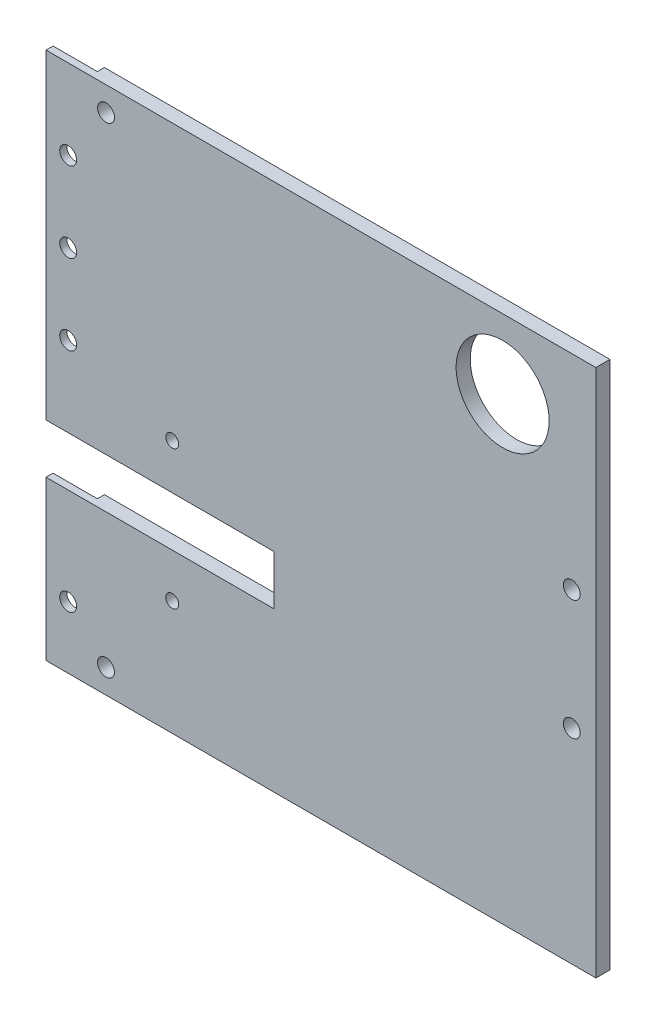
ISO-10303-21;
HEADER;
FILE_DESCRIPTION(('STEP AP214'),'2;1');
FILE_NAME('part.step','',(''),(''),'','','');
FILE_SCHEMA(('AUTOMOTIVE_DESIGN { 1 0 10303 214 1 1 1 1 }'));
ENDSEC;
DATA;
#1=APPLICATION_CONTEXT('core data for automotive mechanical design processes');
#2=APPLICATION_PROTOCOL_DEFINITION('international standard','automotive_design',2000,#1);
#3=PRODUCT_CONTEXT('',#1,'mechanical');
#4=PRODUCT('Part','Part','',(#3));
#5=PRODUCT_RELATED_PRODUCT_CATEGORY('part','',(#4));
#6=PRODUCT_DEFINITION_FORMATION('','',#4);
#7=PRODUCT_DEFINITION_CONTEXT('part definition',#1,'design');
#8=PRODUCT_DEFINITION('design','',#6,#7);
#9=PRODUCT_DEFINITION_SHAPE('','',#8);
#10=(LENGTH_UNIT() NAMED_UNIT(*) SI_UNIT(.MILLI.,.METRE.));
#11=(NAMED_UNIT(*) PLANE_ANGLE_UNIT() SI_UNIT($,.RADIAN.));
#12=(NAMED_UNIT(*) SI_UNIT($,.STERADIAN.) SOLID_ANGLE_UNIT());
#13=UNCERTAINTY_MEASURE_WITH_UNIT(LENGTH_MEASURE(1.E-05),#10,'distance_accuracy_value','');
#14=(GEOMETRIC_REPRESENTATION_CONTEXT(3) GLOBAL_UNCERTAINTY_ASSIGNED_CONTEXT((#13)) GLOBAL_UNIT_ASSIGNED_CONTEXT((#10,
#11,#12)) REPRESENTATION_CONTEXT('',''));
#15=CARTESIAN_POINT('',(0.,0.,0.));
#16=DIRECTION('',(0.,0.,1.));
#17=DIRECTION('',(1.,0.,0.));
#18=AXIS2_PLACEMENT_3D('',#15,#16,#17);
#19=CARTESIAN_POINT('',(0.,0.,0.));
#20=DIRECTION('',(0.,0.,1.));
#21=DIRECTION('',(1.,0.,0.));
#22=AXIS2_PLACEMENT_3D('',#19,#20,#21);
#23=PLANE('',#22);
#24=CARTESIAN_POINT('',(-47.8263067048313,-81.1278307154178,0.));
#25=DIRECTION('',(0.,0.,1.));
#26=DIRECTION('',(1.,0.,0.));
#27=AXIS2_PLACEMENT_3D('',#24,#25,#26);
#28=CIRCLE('',#27,1.90500000000001);
#29=CARTESIAN_POINT('',(-45.9213067048313,-81.1278307154178,0.));
#30=VERTEX_POINT('',#29);
#31=EDGE_CURVE('E165',#30,#30,#28,.T.);
#32=ORIENTED_EDGE('',*,*,#31,.T.);
#33=EDGE_LOOP('',(#32));
#34=FACE_BOUND('',#33,.T.);
#35=CARTESIAN_POINT('',(57.3436932951687,-13.3398307154178,0.));
#36=DIRECTION('',(0.,0.,1.));
#37=DIRECTION('',(1.,0.,0.));
#38=AXIS2_PLACEMENT_3D('',#35,#36,#37);
#39=CIRCLE('',#38,1.90500000000001);
#40=CARTESIAN_POINT('',(59.2486932951687,-13.3398307154178,0.));
#41=VERTEX_POINT('',#40);
#42=EDGE_CURVE('E164',#41,#41,#39,.T.);
#43=ORIENTED_EDGE('',*,*,#42,.T.);
#44=EDGE_LOOP('',(#43));
#45=FACE_BOUND('',#44,.T.);
#46=CARTESIAN_POINT('',(57.3436932951687,-40.4398307154178,0.));
#47=DIRECTION('',(0.,0.,1.));
#48=DIRECTION('',(1.,0.,0.));
#49=AXIS2_PLACEMENT_3D('',#46,#47,#48);
#50=CIRCLE('',#49,1.90500000000001);
#51=CARTESIAN_POINT('',(59.2486932951687,-40.4398307154178,0.));
#52=VERTEX_POINT('',#51);
#53=EDGE_CURVE('E161',#52,#52,#50,.T.);
#54=ORIENTED_EDGE('',*,*,#53,.T.);
#55=EDGE_LOOP('',(#54));
#56=FACE_BOUND('',#55,.T.);
#57=CARTESIAN_POINT('',(-32.8763067048313,-29.3188307154178,0.));
#58=DIRECTION('',(0.,0.,1.));
#59=DIRECTION('',(1.,0.,0.));
#60=AXIS2_PLACEMENT_3D('',#57,#58,#59);
#61=CIRCLE('',#60,1.46);
#62=CARTESIAN_POINT('',(-31.4163067048313,-29.3188307154178,0.));
#63=VERTEX_POINT('',#62);
#64=EDGE_CURVE('E168',#63,#63,#61,.T.);
#65=ORIENTED_EDGE('',*,*,#64,.T.);
#66=EDGE_LOOP('',(#65));
#67=FACE_BOUND('',#66,.T.);
#68=CARTESIAN_POINT('',(-32.8763067048313,-60.6688307154178,0.));
#69=DIRECTION('',(0.,0.,1.));
#70=DIRECTION('',(1.,0.,0.));
#71=AXIS2_PLACEMENT_3D('',#68,#69,#70);
#72=CIRCLE('',#71,1.46);
#73=CARTESIAN_POINT('',(-31.4163067048313,-60.6688307154178,0.));
#74=VERTEX_POINT('',#73);
#75=EDGE_CURVE('E178',#74,#74,#72,.T.);
#76=ORIENTED_EDGE('',*,*,#75,.T.);
#77=EDGE_LOOP('',(#76));
#78=FACE_BOUND('',#77,.T.);
#79=CARTESIAN_POINT('',(41.7296932951687,17.0901692845822,0.));
#80=DIRECTION('',(0.,0.,1.));
#81=DIRECTION('',(1.,0.,0.));
#82=AXIS2_PLACEMENT_3D('',#79,#80,#81);
#83=CIRCLE('',#82,10.5);
#84=CARTESIAN_POINT('',(52.2296932951687,17.0901692845822,0.));
#85=VERTEX_POINT('',#84);
#86=EDGE_CURVE('E175',#85,#85,#83,.T.);
#87=ORIENTED_EDGE('',*,*,#86,.T.);
#88=EDGE_LOOP('',(#87));
#89=FACE_BOUND('',#88,.T.);
#90=CARTESIAN_POINT('',(-47.8263067048313,27.3481692845822,0.));
#91=DIRECTION('',(0.,0.,1.));
#92=DIRECTION('',(1.,0.,0.));
#93=AXIS2_PLACEMENT_3D('',#90,#91,#92);
#94=CIRCLE('',#93,1.90500000000001);
#95=CARTESIAN_POINT('',(-45.9213067048313,27.3481692845822,0.));
#96=VERTEX_POINT('',#95);
#97=EDGE_CURVE('E171',#96,#96,#94,.T.);
#98=ORIENTED_EDGE('',*,*,#97,.T.);
#99=EDGE_LOOP('',(#98));
#100=FACE_BOUND('',#99,.T.);
#101=DIRECTION('',(0.,-1.,0.));
#102=VECTOR('',#101,1.);
#103=CARTESIAN_POINT('',(-51.3763067048313,32.8001682644905,-2.00872967033113E-07));
#104=LINE('',#103,#102);
#105=CARTESIAN_POINT('',(-51.3763067048313,32.8001682644905,-2.00872967033113E-07));
#106=VERTEX_POINT('',#105);
#107=CARTESIAN_POINT('',(-51.3763067048313,-39.5328307154178,0.));
#108=VERTEX_POINT('',#107);
#109=EDGE_CURVE('E60',#106,#108,#104,.T.);
#110=ORIENTED_EDGE('',*,*,#109,.F.);
#111=DIRECTION('',(-1.,0.,0.));
#112=VECTOR('',#111,1.);
#113=CARTESIAN_POINT('',(-61.3763067048313,32.8001692845822,0.));
#114=LINE('',#113,#112);
#115=CARTESIAN_POINT('',(62.7936932951687,32.8001692845822,0.));
#116=VERTEX_POINT('',#115);
#117=EDGE_CURVE('E145',#116,#106,#114,.T.);
#118=ORIENTED_EDGE('',*,*,#117,.F.);
#119=DIRECTION('',(0.,1.,0.));
#120=VECTOR('',#119,1.);
#121=CARTESIAN_POINT('',(62.7936932951687,32.8001692845822,0.));
#122=LINE('',#121,#120);
#123=CARTESIAN_POINT('',(62.7936932951687,-86.5798307154178,0.));
#124=VERTEX_POINT('',#123);
#125=EDGE_CURVE('E244',#124,#116,#122,.T.);
#126=ORIENTED_EDGE('',*,*,#125,.F.);
#127=DIRECTION('',(1.,0.,0.));
#128=VECTOR('',#127,1.);
#129=CARTESIAN_POINT('',(-61.3763067048313,-86.5798307154178,0.));
#130=LINE('',#129,#128);
#131=CARTESIAN_POINT('',(-51.3763067048313,-86.5798307154178,-2.00872952413279E-07));
#132=VERTEX_POINT('',#131);
#133=EDGE_CURVE('E231',#132,#124,#130,.T.);
#134=ORIENTED_EDGE('',*,*,#133,.F.);
#135=CARTESIAN_POINT('',(-51.3763067048313,-50.7328307154178,-2.00872956803271E-07));
#136=VERTEX_POINT('',#135);
#137=EDGE_CURVE('E287',#136,#132,#104,.T.);
#138=ORIENTED_EDGE('',*,*,#137,.F.);
#139=DIRECTION('',(1.,0.,0.));
#140=VECTOR('',#139,1.);
#141=CARTESIAN_POINT('',(-61.3763067048313,-50.7328307154178,0.));
#142=LINE('',#141,#140);
#143=CARTESIAN_POINT('',(-9.87630670483128,-50.7328307154178,0.));
#144=VERTEX_POINT('',#143);
#145=EDGE_CURVE('E174',#136,#144,#142,.T.);
#146=ORIENTED_EDGE('',*,*,#145,.T.);
#147=DIRECTION('',(0.,1.,0.));
#148=VECTOR('',#147,1.);
#149=CARTESIAN_POINT('',(-9.87630670483128,-39.5328307154178,0.));
#150=LINE('',#149,#148);
#151=CARTESIAN_POINT('',(-9.87630670483128,-39.5328307154178,0.));
#152=VERTEX_POINT('',#151);
#153=EDGE_CURVE('E184',#144,#152,#150,.T.);
#154=ORIENTED_EDGE('',*,*,#153,.T.);
#155=DIRECTION('',(-1.,0.,0.));
#156=VECTOR('',#155,1.);
#157=CARTESIAN_POINT('',(-61.3763067048313,-39.5328307154178,0.));
#158=LINE('',#157,#156);
#159=EDGE_CURVE('E187',#152,#108,#158,.T.);
#160=ORIENTED_EDGE('',*,*,#159,.T.);
#161=EDGE_LOOP('',(#110,#118,#126,#134,#138,#146,#154,#160));
#162=FACE_BOUND('',#161,.T.);
#163=ADVANCED_FACE('F37',(#34,#45,#56,#67,#78,#89,#100,#162),#23,.F.);
#164=CARTESIAN_POINT('',(-61.3763067048313,32.8001692845822,3.18));
#165=DIRECTION('',(1.,0.,0.));
#166=DIRECTION('',(0.,1.,0.));
#167=AXIS2_PLACEMENT_3D('',#164,#165,#166);
#168=PLANE('',#167);
#169=DIRECTION('',(0.,0.,-1.));
#170=VECTOR('',#169,1.);
#171=CARTESIAN_POINT('',(-61.3763067048313,-50.7328307154178,23.18));
#172=LINE('',#171,#170);
#173=CARTESIAN_POINT('',(-61.3763067048313,-50.7328307154178,3.18));
#174=VERTEX_POINT('',#173);
#175=CARTESIAN_POINT('',(-61.3763067048313,-50.7328307154178,1.58999979912704));
#176=VERTEX_POINT('',#175);
#177=EDGE_CURVE('E198',#174,#176,#172,.T.);
#178=ORIENTED_EDGE('',*,*,#177,.T.);
#179=DIRECTION('',(0.,1.,0.));
#180=VECTOR('',#179,1.);
#181=CARTESIAN_POINT('',(-61.3763067048313,32.8001682644905,1.58999979912703));
#182=LINE('',#181,#180);
#183=CARTESIAN_POINT('',(-61.3763067048313,-86.5798307154178,1.58999979912705));
#184=VERTEX_POINT('',#183);
#185=EDGE_CURVE('E149',#184,#176,#182,.T.);
#186=ORIENTED_EDGE('',*,*,#185,.F.);
#187=DIRECTION('',(0.,0.,-1.));
#188=VECTOR('',#187,1.);
#189=CARTESIAN_POINT('',(-61.3763067048313,-86.5798307154178,3.18));
#190=LINE('',#189,#188);
#191=CARTESIAN_POINT('',(-61.3763067048313,-86.5798307154178,3.18));
#192=VERTEX_POINT('',#191);
#193=EDGE_CURVE('E253',#192,#184,#190,.T.);
#194=ORIENTED_EDGE('',*,*,#193,.F.);
#195=DIRECTION('',(0.,-1.,0.));
#196=VECTOR('',#195,1.);
#197=CARTESIAN_POINT('',(-61.3763067048313,32.8001692845822,3.18));
#198=LINE('',#197,#196);
#199=EDGE_CURVE('E236',#174,#192,#198,.T.);
#200=ORIENTED_EDGE('',*,*,#199,.F.);
#201=EDGE_LOOP('',(#178,#186,#194,#200));
#202=FACE_BOUND('',#201,.T.);
#203=ADVANCED_FACE('F39',(#202),#168,.F.);
#204=DIRECTION('',(0.,0.,-1.));
#205=VECTOR('',#204,1.);
#206=CARTESIAN_POINT('',(-61.3763067048313,32.8001692845822,3.18));
#207=LINE('',#206,#205);
#208=CARTESIAN_POINT('',(-61.3763067048313,32.8001692845822,3.18));
#209=VERTEX_POINT('',#208);
#210=CARTESIAN_POINT('',(-61.3763067048313,32.8001682644905,1.58999979912703));
#211=VERTEX_POINT('',#210);
#212=EDGE_CURVE('E242',#209,#211,#207,.T.);
#213=ORIENTED_EDGE('',*,*,#212,.T.);
#214=CARTESIAN_POINT('',(-61.3763067048313,-39.5328307154178,1.58999979912704));
#215=VERTEX_POINT('',#214);
#216=EDGE_CURVE('E135',#215,#211,#182,.T.);
#217=ORIENTED_EDGE('',*,*,#216,.F.);
#218=DIRECTION('',(0.,0.,-1.));
#219=VECTOR('',#218,1.);
#220=CARTESIAN_POINT('',(-61.3763067048313,-39.5328307154178,23.18));
#221=LINE('',#220,#219);
#222=CARTESIAN_POINT('',(-61.3763067048313,-39.5328307154178,3.18));
#223=VERTEX_POINT('',#222);
#224=EDGE_CURVE('E190',#223,#215,#221,.T.);
#225=ORIENTED_EDGE('',*,*,#224,.F.);
#226=EDGE_CURVE('E232',#209,#223,#198,.T.);
#227=ORIENTED_EDGE('',*,*,#226,.F.);
#228=EDGE_LOOP('',(#213,#217,#225,#227));
#229=FACE_BOUND('',#228,.T.);
#230=ADVANCED_FACE('F273',(#229),#168,.F.);
#231=CARTESIAN_POINT('',(0.,0.,3.18));
#232=DIRECTION('',(0.,0.,1.));
#233=DIRECTION('',(1.,0.,0.));
#234=AXIS2_PLACEMENT_3D('',#231,#232,#233);
#235=PLANE('',#234);
#236=CARTESIAN_POINT('',(-56.3763067048313,14.7201682644905,3.18));
#237=DIRECTION('',(0.,0.,1.));
#238=DIRECTION('',(1.,0.,0.));
#239=AXIS2_PLACEMENT_3D('',#236,#237,#238);
#240=CIRCLE('',#239,1.905);
#241=CARTESIAN_POINT('',(-54.4713067048313,14.7201682644905,3.18));
#242=VERTEX_POINT('',#241);
#243=EDGE_CURVE('E150',#242,#242,#240,.T.);
#244=ORIENTED_EDGE('',*,*,#243,.F.);
#245=EDGE_LOOP('',(#244));
#246=FACE_BOUND('',#245,.T.);
#247=CARTESIAN_POINT('',(-56.3763067048313,-3.36983173550949,3.18));
#248=DIRECTION('',(0.,0.,1.));
#249=DIRECTION('',(1.,0.,0.));
#250=AXIS2_PLACEMENT_3D('',#247,#248,#249);
#251=CIRCLE('',#250,1.905);
#252=CARTESIAN_POINT('',(-54.4713067048313,-3.36983173550949,3.18));
#253=VERTEX_POINT('',#252);
#254=EDGE_CURVE('E297',#253,#253,#251,.T.);
#255=ORIENTED_EDGE('',*,*,#254,.F.);
#256=EDGE_LOOP('',(#255));
#257=FACE_BOUND('',#256,.T.);
#258=CARTESIAN_POINT('',(-56.3763067048313,-21.4528307154178,3.18));
#259=DIRECTION('',(0.,0.,1.));
#260=DIRECTION('',(1.,0.,0.));
#261=AXIS2_PLACEMENT_3D('',#258,#259,#260);
#262=CIRCLE('',#261,1.905);
#263=CARTESIAN_POINT('',(-54.4713067048313,-21.4528307154178,3.18));
#264=VERTEX_POINT('',#263);
#265=EDGE_CURVE('E300',#264,#264,#262,.T.);
#266=ORIENTED_EDGE('',*,*,#265,.F.);
#267=EDGE_LOOP('',(#266));
#268=FACE_BOUND('',#267,.T.);
#269=CARTESIAN_POINT('',(-56.3763067048313,-72.5798307154178,3.18));
#270=DIRECTION('',(0.,0.,1.));
#271=DIRECTION('',(1.,0.,0.));
#272=AXIS2_PLACEMENT_3D('',#269,#270,#271);
#273=CIRCLE('',#272,1.905);
#274=CARTESIAN_POINT('',(-54.4713067048313,-72.5798307154178,3.18));
#275=VERTEX_POINT('',#274);
#276=EDGE_CURVE('E303',#275,#275,#273,.T.);
#277=ORIENTED_EDGE('',*,*,#276,.F.);
#278=EDGE_LOOP('',(#277));
#279=FACE_BOUND('',#278,.T.);
#280=CARTESIAN_POINT('',(41.7296932951687,17.0901692845822,3.18));
#281=DIRECTION('',(0.,0.,1.));
#282=DIRECTION('',(1.,0.,0.));
#283=AXIS2_PLACEMENT_3D('',#280,#281,#282);
#284=CIRCLE('',#283,10.5);
#285=CARTESIAN_POINT('',(52.2296932951687,17.0901692845822,3.18));
#286=VERTEX_POINT('',#285);
#287=EDGE_CURVE('E225',#286,#286,#284,.F.);
#288=ORIENTED_EDGE('',*,*,#287,.T.);
#289=EDGE_LOOP('',(#288));
#290=FACE_BOUND('',#289,.T.);
#291=CARTESIAN_POINT('',(-32.8763067048313,-29.3188307154178,3.18));
#292=DIRECTION('',(0.,0.,1.));
#293=DIRECTION('',(1.,0.,0.));
#294=AXIS2_PLACEMENT_3D('',#291,#292,#293);
#295=CIRCLE('',#294,1.46);
#296=CARTESIAN_POINT('',(-31.4163067048313,-29.3188307154178,3.18));
#297=VERTEX_POINT('',#296);
#298=EDGE_CURVE('E219',#297,#297,#295,.F.);
#299=ORIENTED_EDGE('',*,*,#298,.T.);
#300=EDGE_LOOP('',(#299));
#301=FACE_BOUND('',#300,.T.);
#302=CARTESIAN_POINT('',(57.3436932951687,-13.3398307154178,3.18));
#303=DIRECTION('',(0.,0.,1.));
#304=DIRECTION('',(1.,0.,0.));
#305=AXIS2_PLACEMENT_3D('',#302,#303,#304);
#306=CIRCLE('',#305,1.90500000000001);
#307=CARTESIAN_POINT('',(59.2486932951687,-13.3398307154178,3.18));
#308=VERTEX_POINT('',#307);
#309=EDGE_CURVE('E213',#308,#308,#306,.F.);
#310=ORIENTED_EDGE('',*,*,#309,.T.);
#311=EDGE_LOOP('',(#310));
#312=FACE_BOUND('',#311,.T.);
#313=DIRECTION('',(0.,-1.,0.));
#314=VECTOR('',#313,1.);
#315=CARTESIAN_POINT('',(-9.87630670483129,0.,3.18));
#316=LINE('',#315,#314);
#317=CARTESIAN_POINT('',(-9.87630670483128,-39.5328307154178,3.18));
#318=VERTEX_POINT('',#317);
#319=CARTESIAN_POINT('',(-9.87630670483128,-50.7328307154178,3.18));
#320=VERTEX_POINT('',#319);
#321=EDGE_CURVE('E204',#318,#320,#316,.T.);
#322=ORIENTED_EDGE('',*,*,#321,.T.);
#323=DIRECTION('',(-1.,0.,0.));
#324=VECTOR('',#323,1.);
#325=CARTESIAN_POINT('',(0.,-50.7328307154178,3.18));
#326=LINE('',#325,#324);
#327=EDGE_CURVE('E207',#320,#174,#326,.T.);
#328=ORIENTED_EDGE('',*,*,#327,.T.);
#329=ORIENTED_EDGE('',*,*,#199,.T.);
#330=DIRECTION('',(1.,0.,0.));
#331=VECTOR('',#330,1.);
#332=CARTESIAN_POINT('',(-61.3763067048313,-86.5798307154178,3.18));
#333=LINE('',#332,#331);
#334=CARTESIAN_POINT('',(62.7936932951687,-86.5798307154178,3.18));
#335=VERTEX_POINT('',#334);
#336=EDGE_CURVE('E235',#192,#335,#333,.T.);
#337=ORIENTED_EDGE('',*,*,#336,.T.);
#338=DIRECTION('',(0.,1.,0.));
#339=VECTOR('',#338,1.);
#340=CARTESIAN_POINT('',(62.7936932951687,32.8001692845822,3.18));
#341=LINE('',#340,#339);
#342=CARTESIAN_POINT('',(62.7936932951687,32.8001692845822,3.18));
#343=VERTEX_POINT('',#342);
#344=EDGE_CURVE('E238',#335,#343,#341,.T.);
#345=ORIENTED_EDGE('',*,*,#344,.T.);
#346=DIRECTION('',(-1.,0.,0.));
#347=VECTOR('',#346,1.);
#348=CARTESIAN_POINT('',(-61.3763067048313,32.8001692845822,3.18));
#349=LINE('',#348,#347);
#350=EDGE_CURVE('E240',#343,#209,#349,.T.);
#351=ORIENTED_EDGE('',*,*,#350,.T.);
#352=ORIENTED_EDGE('',*,*,#226,.T.);
#353=DIRECTION('',(1.,0.,0.));
#354=VECTOR('',#353,1.);
#355=CARTESIAN_POINT('',(0.,-39.5328307154178,3.18));
#356=LINE('',#355,#354);
#357=EDGE_CURVE('E201',#223,#318,#356,.T.);
#358=ORIENTED_EDGE('',*,*,#357,.T.);
#359=EDGE_LOOP('',(#322,#328,#329,#337,#345,#351,#352,#358));
#360=FACE_BOUND('',#359,.T.);
#361=CARTESIAN_POINT('',(-47.8263067048313,-81.1278307154178,3.18));
#362=DIRECTION('',(0.,0.,1.));
#363=DIRECTION('',(1.,0.,0.));
#364=AXIS2_PLACEMENT_3D('',#361,#362,#363);
#365=CIRCLE('',#364,1.90500000000001);
#366=CARTESIAN_POINT('',(-45.9213067048313,-81.1278307154178,3.18));
#367=VERTEX_POINT('',#366);
#368=EDGE_CURVE('E210',#367,#367,#365,.F.);
#369=ORIENTED_EDGE('',*,*,#368,.T.);
#370=EDGE_LOOP('',(#369));
#371=FACE_BOUND('',#370,.T.);
#372=CARTESIAN_POINT('',(57.3436932951687,-40.4398307154178,3.18));
#373=DIRECTION('',(0.,0.,1.));
#374=DIRECTION('',(1.,0.,0.));
#375=AXIS2_PLACEMENT_3D('',#372,#373,#374);
#376=CIRCLE('',#375,1.90500000000001);
#377=CARTESIAN_POINT('',(59.2486932951687,-40.4398307154178,3.18));
#378=VERTEX_POINT('',#377);
#379=EDGE_CURVE('E216',#378,#378,#376,.F.);
#380=ORIENTED_EDGE('',*,*,#379,.T.);
#381=EDGE_LOOP('',(#380));
#382=FACE_BOUND('',#381,.T.);
#383=CARTESIAN_POINT('',(-32.8763067048313,-60.6688307154178,3.18));
#384=DIRECTION('',(0.,0.,1.));
#385=DIRECTION('',(1.,0.,0.));
#386=AXIS2_PLACEMENT_3D('',#383,#384,#385);
#387=CIRCLE('',#386,1.46);
#388=CARTESIAN_POINT('',(-31.4163067048313,-60.6688307154178,3.18));
#389=VERTEX_POINT('',#388);
#390=EDGE_CURVE('E222',#389,#389,#387,.F.);
#391=ORIENTED_EDGE('',*,*,#390,.T.);
#392=EDGE_LOOP('',(#391));
#393=FACE_BOUND('',#392,.T.);
#394=CARTESIAN_POINT('',(-47.8263067048313,27.3481692845822,3.18));
#395=DIRECTION('',(0.,0.,1.));
#396=DIRECTION('',(1.,0.,0.));
#397=AXIS2_PLACEMENT_3D('',#394,#395,#396);
#398=CIRCLE('',#397,1.90500000000001);
#399=CARTESIAN_POINT('',(-45.9213067048313,27.3481692845822,3.18));
#400=VERTEX_POINT('',#399);
#401=EDGE_CURVE('E228',#400,#400,#398,.F.);
#402=ORIENTED_EDGE('',*,*,#401,.T.);
#403=EDGE_LOOP('',(#402));
#404=FACE_BOUND('',#403,.T.);
#405=ADVANCED_FACE('F268',(#246,#257,#268,#279,#290,#301,#312,#360,#371,#382,#393,#404),#235,.T.);
#406=CARTESIAN_POINT('',(-61.3763067048313,-86.5798307154178,3.18));
#407=DIRECTION('',(0.,1.,0.));
#408=DIRECTION('',(0.,0.,1.));
#409=AXIS2_PLACEMENT_3D('',#406,#407,#408);
#410=PLANE('',#409);
#411=ORIENTED_EDGE('',*,*,#193,.T.);
#412=DIRECTION('',(1.,0.,0.));
#413=VECTOR('',#412,1.);
#414=CARTESIAN_POINT('',(-61.3763067048313,-86.5798307154178,1.58999979912705));
#415=LINE('',#414,#413);
#416=CARTESIAN_POINT('',(-51.3763067048313,-86.5798307154178,1.58999979912705));
#417=VERTEX_POINT('',#416);
#418=EDGE_CURVE('E158',#184,#417,#415,.T.);
#419=ORIENTED_EDGE('',*,*,#418,.T.);
#420=DIRECTION('',(0.,0.,1.));
#421=VECTOR('',#420,1.);
#422=CARTESIAN_POINT('',(-51.3763067048313,-86.5798307154178,3.18));
#423=LINE('',#422,#421);
#424=EDGE_CURVE('E154',#132,#417,#423,.T.);
#425=ORIENTED_EDGE('',*,*,#424,.F.);
#426=ORIENTED_EDGE('',*,*,#133,.T.);
#427=DIRECTION('',(0.,0.,-1.));
#428=VECTOR('',#427,1.);
#429=CARTESIAN_POINT('',(62.7936932951687,-86.5798307154178,3.18));
#430=LINE('',#429,#428);
#431=EDGE_CURVE('E250',#335,#124,#430,.T.);
#432=ORIENTED_EDGE('',*,*,#431,.F.);
#433=ORIENTED_EDGE('',*,*,#336,.F.);
#434=EDGE_LOOP('',(#411,#419,#425,#426,#432,#433));
#435=FACE_BOUND('',#434,.T.);
#436=ADVANCED_FACE('F283',(#435),#410,.F.);
#437=CARTESIAN_POINT('',(62.7936932951687,32.8001692845822,3.18));
#438=DIRECTION('',(-1.,0.,0.));
#439=DIRECTION('',(0.,0.,1.));
#440=AXIS2_PLACEMENT_3D('',#437,#438,#439);
#441=PLANE('',#440);
#442=ORIENTED_EDGE('',*,*,#125,.T.);
#443=DIRECTION('',(0.,0.,-1.));
#444=VECTOR('',#443,1.);
#445=CARTESIAN_POINT('',(62.7936932951687,32.8001692845822,3.18));
#446=LINE('',#445,#444);
#447=EDGE_CURVE('E248',#343,#116,#446,.T.);
#448=ORIENTED_EDGE('',*,*,#447,.F.);
#449=ORIENTED_EDGE('',*,*,#344,.F.);
#450=ORIENTED_EDGE('',*,*,#431,.T.);
#451=EDGE_LOOP('',(#442,#448,#449,#450));
#452=FACE_BOUND('',#451,.T.);
#453=ADVANCED_FACE('F279',(#452),#441,.F.);
#454=CARTESIAN_POINT('',(-61.3763067048313,32.8001692845822,3.18));
#455=DIRECTION('',(0.,-1.,0.));
#456=DIRECTION('',(0.,0.,-1.));
#457=AXIS2_PLACEMENT_3D('',#454,#455,#456);
#458=PLANE('',#457);
#459=DIRECTION('',(0.,0.,-1.));
#460=VECTOR('',#459,1.);
#461=CARTESIAN_POINT('',(-51.3763067048313,32.8001682644905,-2.00872967033113E-07));
#462=LINE('',#461,#460);
#463=CARTESIAN_POINT('',(-51.3763067048313,32.8001682644905,1.58999979912703));
#464=VERTEX_POINT('',#463);
#465=EDGE_CURVE('E127',#464,#106,#462,.T.);
#466=ORIENTED_EDGE('',*,*,#465,.F.);
#467=DIRECTION('',(-1.,0.,0.));
#468=VECTOR('',#467,1.);
#469=CARTESIAN_POINT('',(-51.3763067048313,32.8001682644905,1.58999979912703));
#470=LINE('',#469,#468);
#471=EDGE_CURVE('E132',#464,#211,#470,.T.);
#472=ORIENTED_EDGE('',*,*,#471,.T.);
#473=ORIENTED_EDGE('',*,*,#212,.F.);
#474=ORIENTED_EDGE('',*,*,#350,.F.);
#475=ORIENTED_EDGE('',*,*,#447,.T.);
#476=ORIENTED_EDGE('',*,*,#117,.T.);
#477=EDGE_LOOP('',(#466,#472,#473,#474,#475,#476));
#478=FACE_BOUND('',#477,.T.);
#479=ADVANCED_FACE('F142',(#478),#458,.F.);
#480=CARTESIAN_POINT('',(-61.3763067048313,-50.7328307154178,23.18));
#481=DIRECTION('',(0.,1.,0.));
#482=DIRECTION('',(0.,0.,1.));
#483=AXIS2_PLACEMENT_3D('',#480,#481,#482);
#484=PLANE('',#483);
#485=DIRECTION('',(1.,0.,0.));
#486=VECTOR('',#485,1.);
#487=CARTESIAN_POINT('',(-61.3763067048313,-50.7328307154178,1.58999979912704));
#488=LINE('',#487,#486);
#489=CARTESIAN_POINT('',(-51.3763067048313,-50.7328307154178,1.58999979912705));
#490=VERTEX_POINT('',#489);
#491=EDGE_CURVE('E156',#176,#490,#488,.T.);
#492=ORIENTED_EDGE('',*,*,#491,.F.);
#493=ORIENTED_EDGE('',*,*,#177,.F.);
#494=ORIENTED_EDGE('',*,*,#327,.F.);
#495=DIRECTION('',(0.,0.,-1.));
#496=VECTOR('',#495,1.);
#497=CARTESIAN_POINT('',(-9.87630670483128,-50.7328307154178,23.18));
#498=LINE('',#497,#496);
#499=EDGE_CURVE('E195',#320,#144,#498,.T.);
#500=ORIENTED_EDGE('',*,*,#499,.T.);
#501=ORIENTED_EDGE('',*,*,#145,.F.);
#502=DIRECTION('',(0.,0.,1.));
#503=VECTOR('',#502,1.);
#504=CARTESIAN_POINT('',(-51.3763067048313,-50.7328307154178,23.18));
#505=LINE('',#504,#503);
#506=EDGE_CURVE('E139',#136,#490,#505,.T.);
#507=ORIENTED_EDGE('',*,*,#506,.T.);
#508=EDGE_LOOP('',(#492,#493,#494,#500,#501,#507));
#509=FACE_BOUND('',#508,.T.);
#510=ADVANCED_FACE('F293',(#509),#484,.T.);
#511=CARTESIAN_POINT('',(-9.87630670483128,-39.5328307154178,23.18));
#512=DIRECTION('',(-1.,0.,0.));
#513=DIRECTION('',(0.,-1.,0.));
#514=AXIS2_PLACEMENT_3D('',#511,#512,#513);
#515=PLANE('',#514);
#516=DIRECTION('',(0.,0.,-1.));
#517=VECTOR('',#516,1.);
#518=CARTESIAN_POINT('',(-9.87630670483128,-39.5328307154178,23.18));
#519=LINE('',#518,#517);
#520=EDGE_CURVE('E193',#318,#152,#519,.T.);
#521=ORIENTED_EDGE('',*,*,#520,.T.);
#522=ORIENTED_EDGE('',*,*,#153,.F.);
#523=ORIENTED_EDGE('',*,*,#499,.F.);
#524=ORIENTED_EDGE('',*,*,#321,.F.);
#525=EDGE_LOOP('',(#521,#522,#523,#524));
#526=FACE_BOUND('',#525,.T.);
#527=ADVANCED_FACE('F265',(#526),#515,.T.);
#528=CARTESIAN_POINT('',(-61.3763067048313,-39.5328307154178,23.18));
#529=DIRECTION('',(0.,-1.,0.));
#530=DIRECTION('',(0.,0.,-1.));
#531=AXIS2_PLACEMENT_3D('',#528,#529,#530);
#532=PLANE('',#531);
#533=DIRECTION('',(-1.,0.,0.));
#534=VECTOR('',#533,1.);
#535=CARTESIAN_POINT('',(-61.3763067048313,-39.5328307154178,1.58999979912704));
#536=LINE('',#535,#534);
#537=CARTESIAN_POINT('',(-51.3763067048313,-39.5328307154178,1.58999979912704));
#538=VERTEX_POINT('',#537);
#539=EDGE_CURVE('E11',#538,#215,#536,.T.);
#540=ORIENTED_EDGE('',*,*,#539,.F.);
#541=DIRECTION('',(0.,0.,-1.));
#542=VECTOR('',#541,1.);
#543=CARTESIAN_POINT('',(-51.3763067048313,-39.5328307154178,23.18));
#544=LINE('',#543,#542);
#545=EDGE_CURVE('E45',#538,#108,#544,.T.);
#546=ORIENTED_EDGE('',*,*,#545,.T.);
#547=ORIENTED_EDGE('',*,*,#159,.F.);
#548=ORIENTED_EDGE('',*,*,#520,.F.);
#549=ORIENTED_EDGE('',*,*,#357,.F.);
#550=ORIENTED_EDGE('',*,*,#224,.T.);
#551=EDGE_LOOP('',(#540,#546,#547,#548,#549,#550));
#552=FACE_BOUND('',#551,.T.);
#553=ADVANCED_FACE('F257',(#552),#532,.T.);
#554=CARTESIAN_POINT('',(-47.8263067048313,-81.1278307154178,23.18));
#555=DIRECTION('',(0.,0.,-1.));
#556=DIRECTION('',(-1.,0.,0.));
#557=AXIS2_PLACEMENT_3D('',#554,#555,#556);
#558=CYLINDRICAL_SURFACE('',#557,1.90500000000001);
#559=ORIENTED_EDGE('',*,*,#368,.F.);
#560=EDGE_LOOP('',(#559));
#561=FACE_BOUND('',#560,.T.);
#562=ORIENTED_EDGE('',*,*,#31,.F.);
#563=EDGE_LOOP('',(#562));
#564=FACE_BOUND('',#563,.T.);
#565=ADVANCED_FACE('F382',(#561,#564),#558,.F.);
#566=CARTESIAN_POINT('',(57.3436932951687,-13.3398307154178,23.18));
#567=DIRECTION('',(0.,0.,-1.));
#568=DIRECTION('',(-1.,0.,0.));
#569=AXIS2_PLACEMENT_3D('',#566,#567,#568);
#570=CYLINDRICAL_SURFACE('',#569,1.90500000000001);
#571=ORIENTED_EDGE('',*,*,#309,.F.);
#572=EDGE_LOOP('',(#571));
#573=FACE_BOUND('',#572,.T.);
#574=ORIENTED_EDGE('',*,*,#42,.F.);
#575=EDGE_LOOP('',(#574));
#576=FACE_BOUND('',#575,.T.);
#577=ADVANCED_FACE('F378',(#573,#576),#570,.F.);
#578=CARTESIAN_POINT('',(57.3436932951687,-40.4398307154178,23.18));
#579=DIRECTION('',(0.,0.,-1.));
#580=DIRECTION('',(-1.,0.,0.));
#581=AXIS2_PLACEMENT_3D('',#578,#579,#580);
#582=CYLINDRICAL_SURFACE('',#581,1.90500000000001);
#583=ORIENTED_EDGE('',*,*,#379,.F.);
#584=EDGE_LOOP('',(#583));
#585=FACE_BOUND('',#584,.T.);
#586=ORIENTED_EDGE('',*,*,#53,.F.);
#587=EDGE_LOOP('',(#586));
#588=FACE_BOUND('',#587,.T.);
#589=ADVANCED_FACE('F381',(#585,#588),#582,.F.);
#590=CARTESIAN_POINT('',(-32.8763067048313,-29.3188307154178,23.18));
#591=DIRECTION('',(0.,0.,-1.));
#592=DIRECTION('',(-1.,0.,0.));
#593=AXIS2_PLACEMENT_3D('',#590,#591,#592);
#594=CYLINDRICAL_SURFACE('',#593,1.46);
#595=ORIENTED_EDGE('',*,*,#298,.F.);
#596=EDGE_LOOP('',(#595));
#597=FACE_BOUND('',#596,.T.);
#598=ORIENTED_EDGE('',*,*,#64,.F.);
#599=EDGE_LOOP('',(#598));
#600=FACE_BOUND('',#599,.T.);
#601=ADVANCED_FACE('F414',(#597,#600),#594,.F.);
#602=CARTESIAN_POINT('',(-32.8763067048313,-60.6688307154178,23.18));
#603=DIRECTION('',(0.,0.,-1.));
#604=DIRECTION('',(-1.,0.,0.));
#605=AXIS2_PLACEMENT_3D('',#602,#603,#604);
#606=CYLINDRICAL_SURFACE('',#605,1.46);
#607=ORIENTED_EDGE('',*,*,#390,.F.);
#608=EDGE_LOOP('',(#607));
#609=FACE_BOUND('',#608,.T.);
#610=ORIENTED_EDGE('',*,*,#75,.F.);
#611=EDGE_LOOP('',(#610));
#612=FACE_BOUND('',#611,.T.);
#613=ADVANCED_FACE('F406',(#609,#612),#606,.F.);
#614=CARTESIAN_POINT('',(41.7296932951687,17.0901692845822,23.18));
#615=DIRECTION('',(0.,0.,-1.));
#616=DIRECTION('',(-1.,0.,0.));
#617=AXIS2_PLACEMENT_3D('',#614,#615,#616);
#618=CYLINDRICAL_SURFACE('',#617,10.5);
#619=ORIENTED_EDGE('',*,*,#287,.F.);
#620=EDGE_LOOP('',(#619));
#621=FACE_BOUND('',#620,.T.);
#622=ORIENTED_EDGE('',*,*,#86,.F.);
#623=EDGE_LOOP('',(#622));
#624=FACE_BOUND('',#623,.T.);
#625=ADVANCED_FACE('F398',(#621,#624),#618,.F.);
#626=CARTESIAN_POINT('',(-47.8263067048313,27.3481692845822,23.18));
#627=DIRECTION('',(0.,0.,-1.));
#628=DIRECTION('',(-1.,0.,0.));
#629=AXIS2_PLACEMENT_3D('',#626,#627,#628);
#630=CYLINDRICAL_SURFACE('',#629,1.90500000000001);
#631=ORIENTED_EDGE('',*,*,#401,.F.);
#632=EDGE_LOOP('',(#631));
#633=FACE_BOUND('',#632,.T.);
#634=ORIENTED_EDGE('',*,*,#97,.F.);
#635=EDGE_LOOP('',(#634));
#636=FACE_BOUND('',#635,.T.);
#637=ADVANCED_FACE('F396',(#633,#636),#630,.F.);
#638=CARTESIAN_POINT('',(-51.3763067048313,0.,0.));
#639=DIRECTION('',(-1.,0.,0.));
#640=DIRECTION('',(0.,0.,1.));
#641=AXIS2_PLACEMENT_3D('',#638,#639,#640);
#642=PLANE('',#641);
#643=DIRECTION('',(0.,1.,0.));
#644=VECTOR('',#643,1.);
#645=CARTESIAN_POINT('',(-51.3763067048313,32.8001682644905,1.58999979912703));
#646=LINE('',#645,#644);
#647=EDGE_CURVE('E123',#538,#464,#646,.T.);
#648=ORIENTED_EDGE('',*,*,#647,.T.);
#649=ORIENTED_EDGE('',*,*,#465,.T.);
#650=ORIENTED_EDGE('',*,*,#109,.T.);
#651=ORIENTED_EDGE('',*,*,#545,.F.);
#652=EDGE_LOOP('',(#648,#649,#650,#651));
#653=FACE_BOUND('',#652,.T.);
#654=ADVANCED_FACE('F125',(#653),#642,.T.);
#655=CARTESIAN_POINT('',(-51.3763067048313,32.8001682644905,1.58999979912703));
#656=DIRECTION('',(0.,0.,1.));
#657=DIRECTION('',(0.,-1.,0.));
#658=AXIS2_PLACEMENT_3D('',#655,#656,#657);
#659=PLANE('',#658);
#660=CARTESIAN_POINT('',(-56.3763067048313,14.7201682644905,1.58999979912704));
#661=DIRECTION('',(0.,0.,-1.));
#662=DIRECTION('',(0.,1.,0.));
#663=AXIS2_PLACEMENT_3D('',#660,#661,#662);
#664=CIRCLE('',#663,1.905);
#665=CARTESIAN_POINT('',(-56.3763067048313,16.6251682644905,1.58999979912704));
#666=VERTEX_POINT('',#665);
#667=EDGE_CURVE('E306',#666,#666,#664,.T.);
#668=ORIENTED_EDGE('',*,*,#667,.F.);
#669=EDGE_LOOP('',(#668));
#670=FACE_BOUND('',#669,.T.);
#671=CARTESIAN_POINT('',(-56.3763067048313,-3.36983173550949,1.58999979912704));
#672=DIRECTION('',(0.,0.,-1.));
#673=DIRECTION('',(0.,1.,0.));
#674=AXIS2_PLACEMENT_3D('',#671,#672,#673);
#675=CIRCLE('',#674,1.905);
#676=CARTESIAN_POINT('',(-56.3763067048313,-1.46483173550949,1.58999979912704));
#677=VERTEX_POINT('',#676);
#678=EDGE_CURVE('E313',#677,#677,#675,.T.);
#679=ORIENTED_EDGE('',*,*,#678,.F.);
#680=EDGE_LOOP('',(#679));
#681=FACE_BOUND('',#680,.T.);
#682=CARTESIAN_POINT('',(-56.3763067048313,-21.4528307154178,1.58999979912704));
#683=DIRECTION('',(0.,0.,-1.));
#684=DIRECTION('',(0.,1.,0.));
#685=AXIS2_PLACEMENT_3D('',#682,#683,#684);
#686=CIRCLE('',#685,1.905);
#687=CARTESIAN_POINT('',(-56.3763067048313,-19.5478307154178,1.58999979912704));
#688=VERTEX_POINT('',#687);
#689=EDGE_CURVE('E310',#688,#688,#686,.T.);
#690=ORIENTED_EDGE('',*,*,#689,.F.);
#691=EDGE_LOOP('',(#690));
#692=FACE_BOUND('',#691,.T.);
#693=ORIENTED_EDGE('',*,*,#539,.T.);
#694=ORIENTED_EDGE('',*,*,#216,.T.);
#695=ORIENTED_EDGE('',*,*,#471,.F.);
#696=ORIENTED_EDGE('',*,*,#647,.F.);
#697=EDGE_LOOP('',(#693,#694,#695,#696));
#698=FACE_BOUND('',#697,.T.);
#699=ADVANCED_FACE('F133',(#670,#681,#692,#698),#659,.F.);
#700=CARTESIAN_POINT('',(-56.3763067048313,-72.5798307154178,1.58999979912705));
#701=DIRECTION('',(0.,0.,-1.));
#702=DIRECTION('',(0.,1.,0.));
#703=AXIS2_PLACEMENT_3D('',#700,#701,#702);
#704=CIRCLE('',#703,1.905);
#705=CARTESIAN_POINT('',(-56.3763067048313,-70.6748307154178,1.58999979912705));
#706=VERTEX_POINT('',#705);
#707=EDGE_CURVE('E307',#706,#706,#704,.T.);
#708=ORIENTED_EDGE('',*,*,#707,.F.);
#709=EDGE_LOOP('',(#708));
#710=FACE_BOUND('',#709,.T.);
#711=ORIENTED_EDGE('',*,*,#185,.T.);
#712=ORIENTED_EDGE('',*,*,#491,.T.);
#713=EDGE_CURVE('E52',#417,#490,#646,.T.);
#714=ORIENTED_EDGE('',*,*,#713,.F.);
#715=ORIENTED_EDGE('',*,*,#418,.F.);
#716=EDGE_LOOP('',(#711,#712,#714,#715));
#717=FACE_BOUND('',#716,.T.);
#718=ADVANCED_FACE('F289',(#710,#717),#659,.F.);
#719=ORIENTED_EDGE('',*,*,#424,.T.);
#720=ORIENTED_EDGE('',*,*,#713,.T.);
#721=ORIENTED_EDGE('',*,*,#506,.F.);
#722=ORIENTED_EDGE('',*,*,#137,.T.);
#723=EDGE_LOOP('',(#719,#720,#721,#722));
#724=FACE_BOUND('',#723,.T.);
#725=ADVANCED_FACE('F286',(#724),#642,.T.);
#726=CARTESIAN_POINT('',(-56.3763067048313,-72.5798307154178,11.589999799127));
#727=DIRECTION('',(0.,0.,-1.));
#728=DIRECTION('',(0.,1.,0.));
#729=AXIS2_PLACEMENT_3D('',#726,#727,#728);
#730=CYLINDRICAL_SURFACE('',#729,1.905);
#731=ORIENTED_EDGE('',*,*,#276,.T.);
#732=EDGE_LOOP('',(#731));
#733=FACE_BOUND('',#732,.T.);
#734=ORIENTED_EDGE('',*,*,#707,.T.);
#735=EDGE_LOOP('',(#734));
#736=FACE_BOUND('',#735,.T.);
#737=ADVANCED_FACE('F331',(#733,#736),#730,.F.);
#738=CARTESIAN_POINT('',(-56.3763067048313,-21.4528307154178,11.589999799127));
#739=DIRECTION('',(0.,0.,-1.));
#740=DIRECTION('',(0.,1.,0.));
#741=AXIS2_PLACEMENT_3D('',#738,#739,#740);
#742=CYLINDRICAL_SURFACE('',#741,1.905);
#743=ORIENTED_EDGE('',*,*,#265,.T.);
#744=EDGE_LOOP('',(#743));
#745=FACE_BOUND('',#744,.T.);
#746=ORIENTED_EDGE('',*,*,#689,.T.);
#747=EDGE_LOOP('',(#746));
#748=FACE_BOUND('',#747,.T.);
#749=ADVANCED_FACE('F328',(#745,#748),#742,.F.);
#750=CARTESIAN_POINT('',(-56.3763067048313,-3.36983173550949,11.589999799127));
#751=DIRECTION('',(0.,0.,-1.));
#752=DIRECTION('',(0.,1.,0.));
#753=AXIS2_PLACEMENT_3D('',#750,#751,#752);
#754=CYLINDRICAL_SURFACE('',#753,1.905);
#755=ORIENTED_EDGE('',*,*,#254,.T.);
#756=EDGE_LOOP('',(#755));
#757=FACE_BOUND('',#756,.T.);
#758=ORIENTED_EDGE('',*,*,#678,.T.);
#759=EDGE_LOOP('',(#758));
#760=FACE_BOUND('',#759,.T.);
#761=ADVANCED_FACE('F330',(#757,#760),#754,.F.);
#762=CARTESIAN_POINT('',(-56.3763067048313,14.7201682644905,11.589999799127));
#763=DIRECTION('',(0.,0.,-1.));
#764=DIRECTION('',(0.,1.,0.));
#765=AXIS2_PLACEMENT_3D('',#762,#763,#764);
#766=CYLINDRICAL_SURFACE('',#765,1.905);
#767=ORIENTED_EDGE('',*,*,#243,.T.);
#768=EDGE_LOOP('',(#767));
#769=FACE_BOUND('',#768,.T.);
#770=ORIENTED_EDGE('',*,*,#667,.T.);
#771=EDGE_LOOP('',(#770));
#772=FACE_BOUND('',#771,.T.);
#773=ADVANCED_FACE('F319',(#769,#772),#766,.F.);
#774=CLOSED_SHELL('',(#163,#203,#230,#405,#436,#453,#479,#510,#527,#553,#565,#577,#589,#601,
#613,#625,#637,#654,#699,#718,#725,#737,#749,#761,#773));
#775=MANIFOLD_SOLID_BREP('B2',#774);
#776=ADVANCED_BREP_SHAPE_REPRESENTATION('',(#18,#775),#14);
#777=SHAPE_DEFINITION_REPRESENTATION(#9,#776);
ENDSEC;
END-ISO-10303-21;
